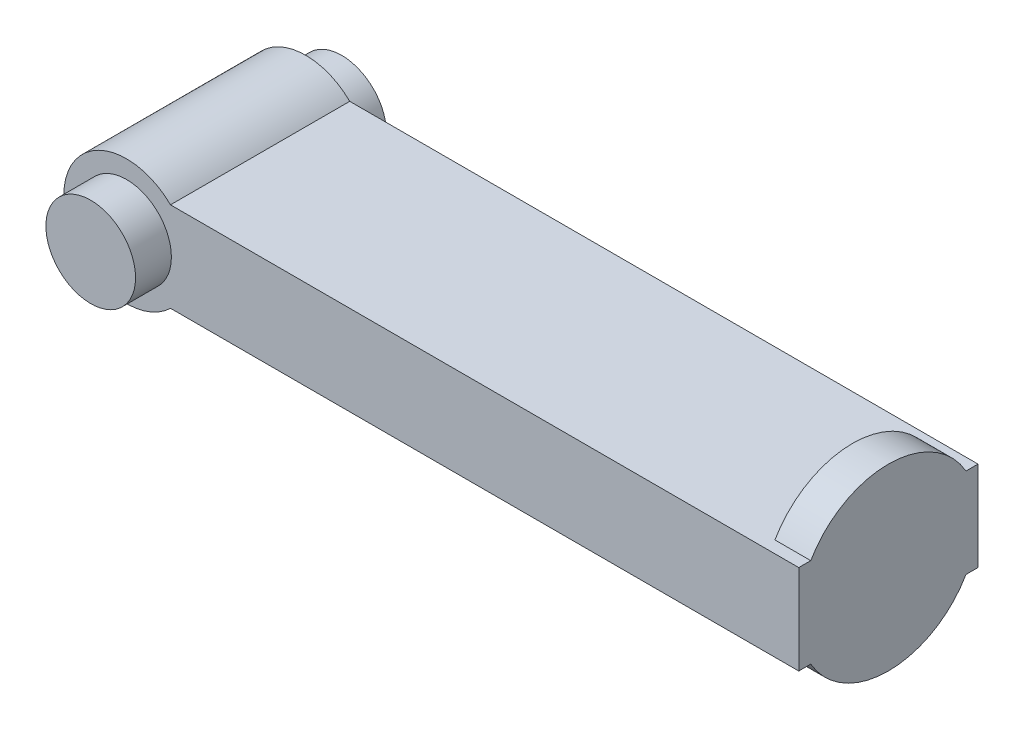
ISO-10303-21;
HEADER;
FILE_DESCRIPTION(('STEP AP214'),'2;1');
FILE_NAME('part.step','',(''),(''),'','','');
FILE_SCHEMA(('AUTOMOTIVE_DESIGN { 1 0 10303 214 1 1 1 1 }'));
ENDSEC;
DATA;
#1=APPLICATION_CONTEXT('core data for automotive mechanical design processes');
#2=APPLICATION_PROTOCOL_DEFINITION('international standard','automotive_design',2000,#1);
#3=PRODUCT_CONTEXT('',#1,'mechanical');
#4=PRODUCT('Part','Part','',(#3));
#5=PRODUCT_RELATED_PRODUCT_CATEGORY('part','',(#4));
#6=PRODUCT_DEFINITION_FORMATION('','',#4);
#7=PRODUCT_DEFINITION_CONTEXT('part definition',#1,'design');
#8=PRODUCT_DEFINITION('design','',#6,#7);
#9=PRODUCT_DEFINITION_SHAPE('','',#8);
#10=(LENGTH_UNIT() NAMED_UNIT(*) SI_UNIT(.MILLI.,.METRE.));
#11=(NAMED_UNIT(*) PLANE_ANGLE_UNIT() SI_UNIT($,.RADIAN.));
#12=(NAMED_UNIT(*) SI_UNIT($,.STERADIAN.) SOLID_ANGLE_UNIT());
#13=UNCERTAINTY_MEASURE_WITH_UNIT(LENGTH_MEASURE(1.E-05),#10,'distance_accuracy_value','');
#14=(GEOMETRIC_REPRESENTATION_CONTEXT(3) GLOBAL_UNCERTAINTY_ASSIGNED_CONTEXT((#13)) GLOBAL_UNIT_ASSIGNED_CONTEXT((#10,
#11,#12)) REPRESENTATION_CONTEXT('',''));
#15=CARTESIAN_POINT('',(0.,0.,0.));
#16=DIRECTION('',(0.,0.,1.));
#17=DIRECTION('',(1.,0.,0.));
#18=AXIS2_PLACEMENT_3D('',#15,#16,#17);
#19=CARTESIAN_POINT('',(0.,0.,100.));
#20=DIRECTION('',(0.,0.,-1.));
#21=DIRECTION('',(-1.,0.,0.));
#22=AXIS2_PLACEMENT_3D('',#19,#20,#21);
#23=CYLINDRICAL_SURFACE('',#22,35.);
#24=CARTESIAN_POINT('',(0.,0.,0.));
#25=DIRECTION('',(0.,0.,1.));
#26=DIRECTION('',(1.,0.,0.));
#27=AXIS2_PLACEMENT_3D('',#24,#25,#26);
#28=CIRCLE('',#27,35.);
#29=CARTESIAN_POINT('',(24.4948974278318,25.,0.));
#30=VERTEX_POINT('',#29);
#31=CARTESIAN_POINT('',(24.4948974278318,-25.,0.));
#32=VERTEX_POINT('',#31);
#33=EDGE_CURVE('E174',#30,#32,#28,.T.);
#34=ORIENTED_EDGE('',*,*,#33,.T.);
#35=DIRECTION('',(0.,0.,-1.));
#36=VECTOR('',#35,1.);
#37=CARTESIAN_POINT('',(24.4948974278318,-25.,100.));
#38=LINE('',#37,#36);
#39=CARTESIAN_POINT('',(24.4948974278318,-25.,100.));
#40=VERTEX_POINT('',#39);
#41=EDGE_CURVE('E58',#40,#32,#38,.T.);
#42=ORIENTED_EDGE('',*,*,#41,.F.);
#43=CARTESIAN_POINT('',(0.,0.,100.));
#44=DIRECTION('',(0.,0.,1.));
#45=DIRECTION('',(1.,0.,0.));
#46=AXIS2_PLACEMENT_3D('',#43,#44,#45);
#47=CIRCLE('',#46,35.);
#48=CARTESIAN_POINT('',(24.4948974278318,25.,100.));
#49=VERTEX_POINT('',#48);
#50=EDGE_CURVE('E175',#49,#40,#47,.T.);
#51=ORIENTED_EDGE('',*,*,#50,.F.);
#52=DIRECTION('',(0.,0.,-1.));
#53=VECTOR('',#52,1.);
#54=CARTESIAN_POINT('',(24.4948974278318,25.,100.));
#55=LINE('',#54,#53);
#56=EDGE_CURVE('E138',#49,#30,#55,.T.);
#57=ORIENTED_EDGE('',*,*,#56,.T.);
#58=EDGE_LOOP('',(#34,#42,#51,#57));
#59=FACE_BOUND('',#58,.T.);
#60=ADVANCED_FACE('F49',(#59),#23,.T.);
#61=CARTESIAN_POINT('',(24.4948974278318,-25.,100.));
#62=DIRECTION('',(0.,1.,0.));
#63=DIRECTION('',(-1.,0.,0.));
#64=AXIS2_PLACEMENT_3D('',#61,#62,#63);
#65=PLANE('',#64);
#66=DIRECTION('',(0.,0.,-1.));
#67=VECTOR('',#66,1.);
#68=CARTESIAN_POINT('',(355.,-25.,100.));
#69=LINE('',#68,#67);
#70=CARTESIAN_POINT('',(355.,-25.,93.3012701892219));
#71=VERTEX_POINT('',#70);
#72=CARTESIAN_POINT('',(355.,-25.,6.69872981077806));
#73=VERTEX_POINT('',#72);
#74=EDGE_CURVE('E162',#71,#73,#69,.T.);
#75=ORIENTED_EDGE('',*,*,#74,.F.);
#76=DIRECTION('',(1.,0.,0.));
#77=VECTOR('',#76,1.);
#78=CARTESIAN_POINT('',(355.,-25.,93.3012701892219));
#79=LINE('',#78,#77);
#80=CARTESIAN_POINT('',(375.,-25.,93.3012701892219));
#81=VERTEX_POINT('',#80);
#82=EDGE_CURVE('E170',#71,#81,#79,.T.);
#83=ORIENTED_EDGE('',*,*,#82,.T.);
#84=DIRECTION('',(0.,0.,-1.));
#85=VECTOR('',#84,1.);
#86=CARTESIAN_POINT('',(375.,-25.,100.));
#87=LINE('',#86,#85);
#88=CARTESIAN_POINT('',(375.,-25.,100.));
#89=VERTEX_POINT('',#88);
#90=EDGE_CURVE('E205',#89,#81,#87,.T.);
#91=ORIENTED_EDGE('',*,*,#90,.F.);
#92=DIRECTION('',(1.,0.,0.));
#93=VECTOR('',#92,1.);
#94=CARTESIAN_POINT('',(24.4948974278318,-25.,100.));
#95=LINE('',#94,#93);
#96=EDGE_CURVE('E179',#40,#89,#95,.T.);
#97=ORIENTED_EDGE('',*,*,#96,.F.);
#98=ORIENTED_EDGE('',*,*,#41,.T.);
#99=DIRECTION('',(1.,0.,0.));
#100=VECTOR('',#99,1.);
#101=CARTESIAN_POINT('',(24.4948974278318,-25.,0.));
#102=LINE('',#101,#100);
#103=CARTESIAN_POINT('',(375.,-25.,0.));
#104=VERTEX_POINT('',#103);
#105=EDGE_CURVE('E192',#32,#104,#102,.T.);
#106=ORIENTED_EDGE('',*,*,#105,.T.);
#107=CARTESIAN_POINT('',(375.,-25.,6.69872981077806));
#108=VERTEX_POINT('',#107);
#109=EDGE_CURVE('E204',#108,#104,#87,.T.);
#110=ORIENTED_EDGE('',*,*,#109,.F.);
#111=DIRECTION('',(1.,0.,0.));
#112=VECTOR('',#111,1.);
#113=CARTESIAN_POINT('',(355.,-25.,6.69872981077806));
#114=LINE('',#113,#112);
#115=EDGE_CURVE('E148',#108,#73,#114,.F.);
#116=ORIENTED_EDGE('',*,*,#115,.T.);
#117=EDGE_LOOP('',(#75,#83,#91,#97,#98,#106,#110,#116));
#118=FACE_BOUND('',#117,.T.);
#119=ADVANCED_FACE('F212',(#118),#65,.F.);
#120=CARTESIAN_POINT('',(375.,25.,100.));
#121=DIRECTION('',(-1.,0.,0.));
#122=DIRECTION('',(0.,0.,1.));
#123=AXIS2_PLACEMENT_3D('',#120,#121,#122);
#124=PLANE('',#123);
#125=ORIENTED_EDGE('',*,*,#90,.T.);
#126=CARTESIAN_POINT('',(375.,0.,50.));
#127=DIRECTION('',(1.,0.,0.));
#128=DIRECTION('',(0.,0.,-1.));
#129=AXIS2_PLACEMENT_3D('',#126,#127,#128);
#130=CIRCLE('',#129,50.);
#131=EDGE_CURVE('E69',#81,#108,#130,.T.);
#132=ORIENTED_EDGE('',*,*,#131,.T.);
#133=ORIENTED_EDGE('',*,*,#109,.T.);
#134=DIRECTION('',(0.,1.,0.));
#135=VECTOR('',#134,1.);
#136=CARTESIAN_POINT('',(375.,25.,0.));
#137=LINE('',#136,#135);
#138=CARTESIAN_POINT('',(375.,25.,0.));
#139=VERTEX_POINT('',#138);
#140=EDGE_CURVE('E134',#104,#139,#137,.T.);
#141=ORIENTED_EDGE('',*,*,#140,.T.);
#142=DIRECTION('',(0.,0.,-1.));
#143=VECTOR('',#142,1.);
#144=CARTESIAN_POINT('',(375.,25.,100.));
#145=LINE('',#144,#143);
#146=CARTESIAN_POINT('',(375.,25.,6.69872981077806));
#147=VERTEX_POINT('',#146);
#148=EDGE_CURVE('E127',#147,#139,#145,.T.);
#149=ORIENTED_EDGE('',*,*,#148,.F.);
#150=CARTESIAN_POINT('',(375.,25.,93.3012701892219));
#151=VERTEX_POINT('',#150);
#152=EDGE_CURVE('E132',#147,#151,#130,.T.);
#153=ORIENTED_EDGE('',*,*,#152,.T.);
#154=CARTESIAN_POINT('',(375.,25.,100.));
#155=VERTEX_POINT('',#154);
#156=EDGE_CURVE('E137',#155,#151,#145,.T.);
#157=ORIENTED_EDGE('',*,*,#156,.F.);
#158=DIRECTION('',(0.,1.,0.));
#159=VECTOR('',#158,1.);
#160=CARTESIAN_POINT('',(375.,25.,100.));
#161=LINE('',#160,#159);
#162=EDGE_CURVE('E183',#89,#155,#161,.T.);
#163=ORIENTED_EDGE('',*,*,#162,.F.);
#164=EDGE_LOOP('',(#125,#132,#133,#141,#149,#153,#157,#163));
#165=FACE_BOUND('',#164,.T.);
#166=ADVANCED_FACE('F129',(#165),#124,.F.);
#167=CARTESIAN_POINT('',(24.4948974278318,25.,100.));
#168=DIRECTION('',(0.,-1.,0.));
#169=DIRECTION('',(0.,0.,-1.));
#170=AXIS2_PLACEMENT_3D('',#167,#168,#169);
#171=PLANE('',#170);
#172=DIRECTION('',(0.,0.,1.));
#173=VECTOR('',#172,1.);
#174=CARTESIAN_POINT('',(355.,25.,100.));
#175=LINE('',#174,#173);
#176=CARTESIAN_POINT('',(355.,25.,6.69872981077806));
#177=VERTEX_POINT('',#176);
#178=CARTESIAN_POINT('',(355.,25.,93.3012701892219));
#179=VERTEX_POINT('',#178);
#180=EDGE_CURVE('E143',#177,#179,#175,.T.);
#181=ORIENTED_EDGE('',*,*,#180,.F.);
#182=DIRECTION('',(1.,0.,0.));
#183=VECTOR('',#182,1.);
#184=CARTESIAN_POINT('',(355.,25.,6.69872981077806));
#185=LINE('',#184,#183);
#186=EDGE_CURVE('E141',#177,#147,#185,.T.);
#187=ORIENTED_EDGE('',*,*,#186,.T.);
#188=ORIENTED_EDGE('',*,*,#148,.T.);
#189=DIRECTION('',(-1.,0.,0.));
#190=VECTOR('',#189,1.);
#191=CARTESIAN_POINT('',(24.4948974278318,25.,0.));
#192=LINE('',#191,#190);
#193=EDGE_CURVE('E180',#139,#30,#192,.T.);
#194=ORIENTED_EDGE('',*,*,#193,.T.);
#195=ORIENTED_EDGE('',*,*,#56,.F.);
#196=DIRECTION('',(-1.,0.,0.));
#197=VECTOR('',#196,1.);
#198=CARTESIAN_POINT('',(24.4948974278318,25.,100.));
#199=LINE('',#198,#197);
#200=EDGE_CURVE('E186',#155,#49,#199,.T.);
#201=ORIENTED_EDGE('',*,*,#200,.F.);
#202=ORIENTED_EDGE('',*,*,#156,.T.);
#203=DIRECTION('',(1.,0.,0.));
#204=VECTOR('',#203,1.);
#205=CARTESIAN_POINT('',(355.,25.,93.3012701892219));
#206=LINE('',#205,#204);
#207=EDGE_CURVE('E80',#151,#179,#206,.F.);
#208=ORIENTED_EDGE('',*,*,#207,.T.);
#209=EDGE_LOOP('',(#181,#187,#188,#194,#195,#201,#202,#208));
#210=FACE_BOUND('',#209,.T.);
#211=ADVANCED_FACE('F142',(#210),#171,.F.);
#212=CARTESIAN_POINT('',(0.,0.,100.));
#213=DIRECTION('',(0.,0.,1.));
#214=DIRECTION('',(1.,0.,0.));
#215=AXIS2_PLACEMENT_3D('',#212,#213,#214);
#216=PLANE('',#215);
#217=CARTESIAN_POINT('',(0.,0.,100.));
#218=DIRECTION('',(0.,0.,1.));
#219=DIRECTION('',(1.,0.,0.));
#220=AXIS2_PLACEMENT_3D('',#217,#218,#219);
#221=CIRCLE('',#220,25.);
#222=CARTESIAN_POINT('',(25.,0.,100.));
#223=VERTEX_POINT('',#222);
#224=EDGE_CURVE('E11',#223,#223,#221,.T.);
#225=ORIENTED_EDGE('',*,*,#224,.F.);
#226=EDGE_LOOP('',(#225));
#227=FACE_BOUND('',#226,.T.);
#228=ORIENTED_EDGE('',*,*,#162,.T.);
#229=ORIENTED_EDGE('',*,*,#200,.T.);
#230=ORIENTED_EDGE('',*,*,#50,.T.);
#231=ORIENTED_EDGE('',*,*,#96,.T.);
#232=EDGE_LOOP('',(#228,#229,#230,#231));
#233=FACE_BOUND('',#232,.T.);
#234=ADVANCED_FACE('F223',(#227,#233),#216,.T.);
#235=CARTESIAN_POINT('',(0.,0.,0.));
#236=DIRECTION('',(0.,0.,1.));
#237=DIRECTION('',(1.,0.,0.));
#238=AXIS2_PLACEMENT_3D('',#235,#236,#237);
#239=PLANE('',#238);
#240=CARTESIAN_POINT('',(0.,0.,0.));
#241=DIRECTION('',(0.,0.,1.));
#242=DIRECTION('',(1.,0.,0.));
#243=AXIS2_PLACEMENT_3D('',#240,#241,#242);
#244=CIRCLE('',#243,25.);
#245=CARTESIAN_POINT('',(25.,0.,0.));
#246=VERTEX_POINT('',#245);
#247=EDGE_CURVE('E52',#246,#246,#244,.T.);
#248=ORIENTED_EDGE('',*,*,#247,.T.);
#249=EDGE_LOOP('',(#248));
#250=FACE_BOUND('',#249,.T.);
#251=ORIENTED_EDGE('',*,*,#193,.F.);
#252=ORIENTED_EDGE('',*,*,#140,.F.);
#253=ORIENTED_EDGE('',*,*,#105,.F.);
#254=ORIENTED_EDGE('',*,*,#33,.F.);
#255=EDGE_LOOP('',(#251,#252,#253,#254));
#256=FACE_BOUND('',#255,.T.);
#257=ADVANCED_FACE('F220',(#250,#256),#239,.F.);
#258=CARTESIAN_POINT('',(355.,0.,50.));
#259=DIRECTION('',(1.,0.,0.));
#260=DIRECTION('',(0.,0.,-1.));
#261=AXIS2_PLACEMENT_3D('',#258,#259,#260);
#262=PLANE('',#261);
#263=CARTESIAN_POINT('',(355.,0.,50.));
#264=DIRECTION('',(1.,0.,0.));
#265=DIRECTION('',(0.,0.,-1.));
#266=AXIS2_PLACEMENT_3D('',#263,#264,#265);
#267=CIRCLE('',#266,50.);
#268=EDGE_CURVE('E157',#177,#179,#267,.T.);
#269=ORIENTED_EDGE('',*,*,#268,.F.);
#270=ORIENTED_EDGE('',*,*,#180,.T.);
#271=EDGE_LOOP('',(#269,#270));
#272=FACE_BOUND('',#271,.T.);
#273=ADVANCED_FACE('F233',(#272),#262,.F.);
#274=CARTESIAN_POINT('',(355.,0.,50.));
#275=DIRECTION('',(1.,0.,0.));
#276=DIRECTION('',(0.,0.,-1.));
#277=AXIS2_PLACEMENT_3D('',#274,#275,#276);
#278=CYLINDRICAL_SURFACE('',#277,50.);
#279=ORIENTED_EDGE('',*,*,#186,.F.);
#280=ORIENTED_EDGE('',*,*,#268,.T.);
#281=ORIENTED_EDGE('',*,*,#207,.F.);
#282=ORIENTED_EDGE('',*,*,#152,.F.);
#283=EDGE_LOOP('',(#279,#280,#281,#282));
#284=FACE_BOUND('',#283,.T.);
#285=ADVANCED_FACE('F150',(#284),#278,.T.);
#286=ORIENTED_EDGE('',*,*,#82,.F.);
#287=EDGE_CURVE('E152',#71,#73,#267,.T.);
#288=ORIENTED_EDGE('',*,*,#287,.T.);
#289=ORIENTED_EDGE('',*,*,#115,.F.);
#290=ORIENTED_EDGE('',*,*,#131,.F.);
#291=EDGE_LOOP('',(#286,#288,#289,#290));
#292=FACE_BOUND('',#291,.T.);
#293=ADVANCED_FACE('F227',(#292),#278,.T.);
#294=ORIENTED_EDGE('',*,*,#287,.F.);
#295=ORIENTED_EDGE('',*,*,#74,.T.);
#296=EDGE_LOOP('',(#294,#295));
#297=FACE_BOUND('',#296,.T.);
#298=ADVANCED_FACE('F229',(#297),#262,.F.);
#299=CARTESIAN_POINT('',(0.,0.,-20.));
#300=DIRECTION('',(0.,0.,1.));
#301=DIRECTION('',(1.,0.,0.));
#302=AXIS2_PLACEMENT_3D('',#299,#300,#301);
#303=PLANE('',#302);
#304=CARTESIAN_POINT('',(0.,0.,-20.));
#305=DIRECTION('',(0.,0.,1.));
#306=DIRECTION('',(1.,0.,0.));
#307=AXIS2_PLACEMENT_3D('',#304,#305,#306);
#308=CIRCLE('',#307,25.);
#309=CARTESIAN_POINT('',(25.,0.,-20.));
#310=VERTEX_POINT('',#309);
#311=EDGE_CURVE('E272',#310,#310,#308,.T.);
#312=ORIENTED_EDGE('',*,*,#311,.F.);
#313=EDGE_LOOP('',(#312));
#314=FACE_BOUND('',#313,.T.);
#315=ADVANCED_FACE('F231',(#314),#303,.F.);
#316=CARTESIAN_POINT('',(0.,0.,-20.));
#317=DIRECTION('',(0.,0.,1.));
#318=DIRECTION('',(1.,0.,0.));
#319=AXIS2_PLACEMENT_3D('',#316,#317,#318);
#320=CYLINDRICAL_SURFACE('',#319,25.);
#321=ORIENTED_EDGE('',*,*,#311,.T.);
#322=EDGE_LOOP('',(#321));
#323=FACE_BOUND('',#322,.T.);
#324=ORIENTED_EDGE('',*,*,#247,.F.);
#325=EDGE_LOOP('',(#324));
#326=FACE_BOUND('',#325,.T.);
#327=ADVANCED_FACE('F239',(#323,#326),#320,.T.);
#328=ORIENTED_EDGE('',*,*,#224,.T.);
#329=EDGE_LOOP('',(#328));
#330=FACE_BOUND('',#329,.T.);
#331=CARTESIAN_POINT('',(0.,0.,120.));
#332=DIRECTION('',(0.,0.,1.));
#333=DIRECTION('',(1.,0.,0.));
#334=AXIS2_PLACEMENT_3D('',#331,#332,#333);
#335=CIRCLE('',#334,25.);
#336=CARTESIAN_POINT('',(25.,0.,120.));
#337=VERTEX_POINT('',#336);
#338=EDGE_CURVE('E269',#337,#337,#335,.T.);
#339=ORIENTED_EDGE('',*,*,#338,.F.);
#340=EDGE_LOOP('',(#339));
#341=FACE_BOUND('',#340,.T.);
#342=ADVANCED_FACE('F263',(#330,#341),#320,.T.);
#343=CARTESIAN_POINT('',(0.,0.,120.));
#344=DIRECTION('',(0.,0.,1.));
#345=DIRECTION('',(1.,0.,0.));
#346=AXIS2_PLACEMENT_3D('',#343,#344,#345);
#347=PLANE('',#346);
#348=ORIENTED_EDGE('',*,*,#338,.T.);
#349=EDGE_LOOP('',(#348));
#350=FACE_BOUND('',#349,.T.);
#351=ADVANCED_FACE('F266',(#350),#347,.T.);
#352=CLOSED_SHELL('',(#60,#119,#166,#211,#234,#257,#273,#285,#293,#298,#315,#327,#342,#351));
#353=MANIFOLD_SOLID_BREP('B2',#352);
#354=ADVANCED_BREP_SHAPE_REPRESENTATION('',(#18,#353),#14);
#355=SHAPE_DEFINITION_REPRESENTATION(#9,#354);
ENDSEC;
END-ISO-10303-21;
